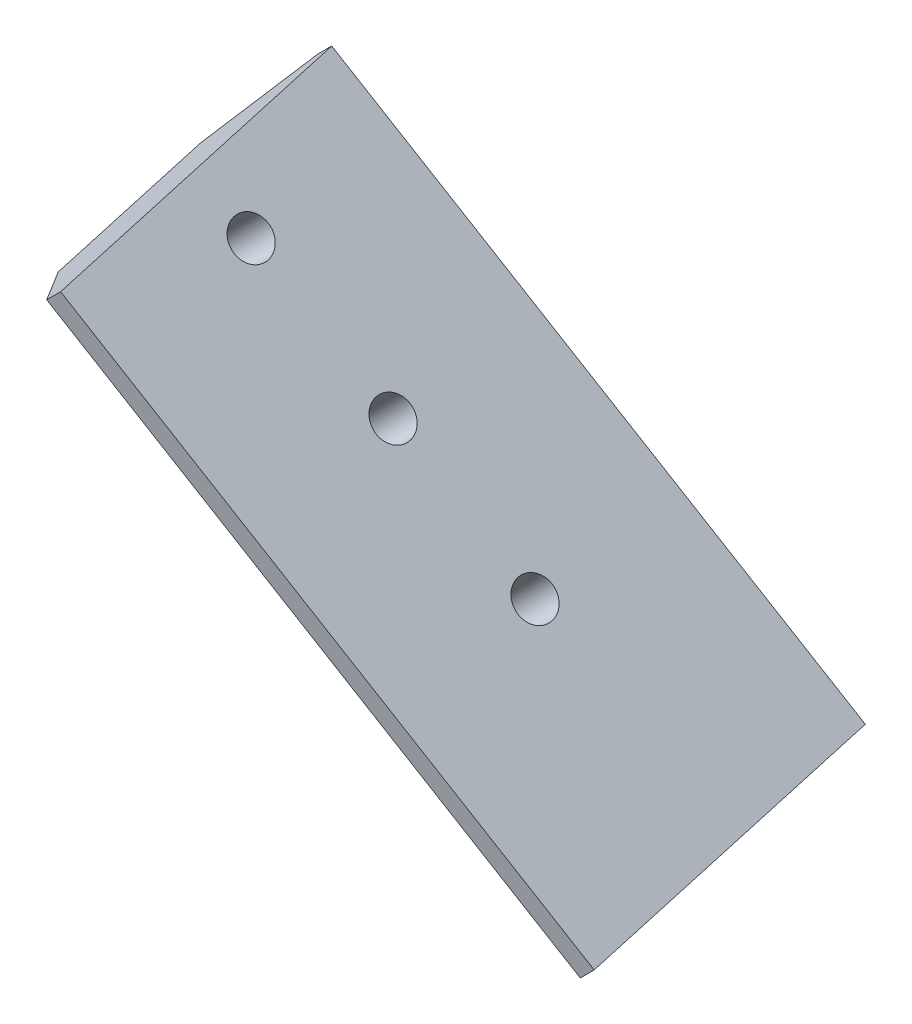
ISO-10303-21;
HEADER;
FILE_DESCRIPTION(('STEP AP214'),'2;1');
FILE_NAME('part.step','',(''),(''),'','','');
FILE_SCHEMA(('AUTOMOTIVE_DESIGN { 1 0 10303 214 1 1 1 1 }'));
ENDSEC;
DATA;
#1=APPLICATION_CONTEXT('core data for automotive mechanical design processes');
#2=APPLICATION_PROTOCOL_DEFINITION('international standard','automotive_design',2000,#1);
#3=PRODUCT_CONTEXT('',#1,'mechanical');
#4=PRODUCT('Part','Part','',(#3));
#5=PRODUCT_RELATED_PRODUCT_CATEGORY('part','',(#4));
#6=PRODUCT_DEFINITION_FORMATION('','',#4);
#7=PRODUCT_DEFINITION_CONTEXT('part definition',#1,'design');
#8=PRODUCT_DEFINITION('design','',#6,#7);
#9=PRODUCT_DEFINITION_SHAPE('','',#8);
#10=(LENGTH_UNIT() NAMED_UNIT(*) SI_UNIT(.MILLI.,.METRE.));
#11=(NAMED_UNIT(*) PLANE_ANGLE_UNIT() SI_UNIT($,.RADIAN.));
#12=(NAMED_UNIT(*) SI_UNIT($,.STERADIAN.) SOLID_ANGLE_UNIT());
#13=UNCERTAINTY_MEASURE_WITH_UNIT(LENGTH_MEASURE(1.E-05),#10,'distance_accuracy_value','');
#14=(GEOMETRIC_REPRESENTATION_CONTEXT(3) GLOBAL_UNCERTAINTY_ASSIGNED_CONTEXT((#13)) GLOBAL_UNIT_ASSIGNED_CONTEXT((#10,
#11,#12)) REPRESENTATION_CONTEXT('',''));
#15=CARTESIAN_POINT('',(0.,0.,0.));
#16=DIRECTION('',(0.,0.,1.));
#17=DIRECTION('',(1.,0.,0.));
#18=AXIS2_PLACEMENT_3D('',#15,#16,#17);
#19=CARTESIAN_POINT('',(2301.17091138971,-454.636764766131,75.5684436134808));
#20=DIRECTION('',(-0.707106781186548,-0.707106781186547,-1.38414541674983E-13));
#21=DIRECTION('',(0.707106781186547,-0.707106781186548,0.));
#22=AXIS2_PLACEMENT_3D('',#19,#20,#21);
#23=CONICAL_SURFACE('',#22,3.45000000012907,0.785398163395434);
#24=CARTESIAN_POINT('',(2301.17091138977,-454.636764766074,75.5684436134808));
#25=DIRECTION('',(-0.707106781186548,-0.707106781186547,-1.38414541674983E-13));
#26=DIRECTION('',(0.707106781186547,-0.707106781186548,0.));
#27=AXIS2_PLACEMENT_3D('',#24,#25,#26);
#28=CIRCLE('',#27,3.45000000004904);
#29=CARTESIAN_POINT('',(2303.6104297849,-457.076283161203,75.5684436134808));
#30=VERTEX_POINT('',#29);
#31=EDGE_CURVE('E122',#30,#30,#28,.F.);
#32=ORIENTED_EDGE('',*,*,#31,.F.);
#33=EDGE_LOOP('',(#32));
#34=FACE_BOUND('',#33,.T.);
#35=CARTESIAN_POINT('',(2301.84266283199,-453.965013323851,75.5684436134809));
#36=DIRECTION('',(-0.707106781186503,-0.707106781186592,0.));
#37=DIRECTION('',(0.707106781186592,-0.707106781186503,0.));
#38=AXIS2_PLACEMENT_3D('',#35,#36,#37);
#39=CIRCLE('',#38,2.5);
#40=CARTESIAN_POINT('',(2303.61042978496,-455.732780276817,75.5684436134809));
#41=VERTEX_POINT('',#40);
#42=EDGE_CURVE('E101',#41,#41,#39,.F.);
#43=ORIENTED_EDGE('',*,*,#42,.T.);
#44=EDGE_LOOP('',(#43));
#45=FACE_BOUND('',#44,.T.);
#46=ADVANCED_FACE('F17',(#34,#45),#23,.F.);
#47=CARTESIAN_POINT('',(2330.07002735808,-483.535880734265,68.36204424156));
#48=DIRECTION('',(-0.707106781186434,-0.707106781186661,0.));
#49=DIRECTION('',(0.707106781186661,-0.707106781186434,0.));
#50=AXIS2_PLACEMENT_3D('',#47,#48,#49);
#51=CONICAL_SURFACE('',#50,3.45000000007031,0.785398163408309);
#52=CARTESIAN_POINT('',(2330.07002735816,-483.535880734184,68.36204424156));
#53=DIRECTION('',(-0.707106781186434,-0.707106781186661,0.));
#54=DIRECTION('',(0.707106781186661,-0.707106781186434,0.));
#55=AXIS2_PLACEMENT_3D('',#52,#53,#54);
#56=CIRCLE('',#55,3.44999999995523);
#57=CARTESIAN_POINT('',(2332.50954575322,-485.975399129245,68.36204424156));
#58=VERTEX_POINT('',#57);
#59=EDGE_CURVE('E20',#58,#58,#56,.F.);
#60=ORIENTED_EDGE('',*,*,#59,.F.);
#61=EDGE_LOOP('',(#60));
#62=FACE_BOUND('',#61,.T.);
#63=CARTESIAN_POINT('',(2330.74177880024,-482.864129292097,68.3620442415602));
#64=DIRECTION('',(-0.707106781186503,-0.707106781186592,0.));
#65=DIRECTION('',(0.707106781186592,-0.707106781186503,0.));
#66=AXIS2_PLACEMENT_3D('',#63,#64,#65);
#67=CIRCLE('',#66,2.5);
#68=CARTESIAN_POINT('',(2332.50954575321,-484.631896245063,68.3620442415602));
#69=VERTEX_POINT('',#68);
#70=EDGE_CURVE('E106',#69,#69,#67,.F.);
#71=ORIENTED_EDGE('',*,*,#70,.T.);
#72=EDGE_LOOP('',(#71));
#73=FACE_BOUND('',#72,.T.);
#74=ADVANCED_FACE('F131',(#62,#73),#51,.F.);
#75=CARTESIAN_POINT('',(2315.62046937664,-469.086322752486,71.965243926872));
#76=DIRECTION('',(-0.707106781186513,-0.707106781186582,0.));
#77=DIRECTION('',(0.707106781186582,-0.707106781186513,0.));
#78=AXIS2_PLACEMENT_3D('',#75,#76,#77);
#79=CONICAL_SURFACE('',#78,3.44999999985659,0.785398163417411);
#80=CARTESIAN_POINT('',(2315.62046937657,-469.086322752556,71.965243926872));
#81=DIRECTION('',(-0.707106781186513,-0.707106781186582,0.));
#82=DIRECTION('',(0.707106781186582,-0.707106781186513,0.));
#83=AXIS2_PLACEMENT_3D('',#80,#81,#82);
#84=CIRCLE('',#83,3.44999999995523);
#85=CARTESIAN_POINT('',(2318.05998777163,-471.525841147618,71.965243926872));
#86=VERTEX_POINT('',#85);
#87=EDGE_CURVE('E103',#86,#86,#84,.F.);
#88=ORIENTED_EDGE('',*,*,#87,.F.);
#89=EDGE_LOOP('',(#88));
#90=FACE_BOUND('',#89,.T.);
#91=CARTESIAN_POINT('',(2316.29222081863,-468.41457131049,71.9652439268721));
#92=DIRECTION('',(-0.707106781186503,-0.707106781186592,0.));
#93=DIRECTION('',(0.707106781186592,-0.707106781186503,0.));
#94=AXIS2_PLACEMENT_3D('',#91,#92,#93);
#95=CIRCLE('',#94,2.5);
#96=CARTESIAN_POINT('',(2318.0599877716,-470.182338263456,71.9652439268721));
#97=VERTEX_POINT('',#96);
#98=EDGE_CURVE('E81',#97,#97,#95,.F.);
#99=ORIENTED_EDGE('',*,*,#98,.T.);
#100=EDGE_LOOP('',(#99));
#101=FACE_BOUND('',#100,.T.);
#102=ADVANCED_FACE('F134',(#90,#101),#79,.F.);
#103=CARTESIAN_POINT('',(2326.32812028619,-466.358944819765,50.6991222747484));
#104=DIRECTION('',(-0.586824088833399,-0.41317591116653,-0.696364240320077));
#105=DIRECTION('',(-0.764688187763723,0.,0.644400477571698));
#106=AXIS2_PLACEMENT_3D('',#103,#104,#105);
#107=PLANE('',#106);
#108=DIRECTION('',(0.696364240320073,-0.696364240319967,-0.173648177666922));
#109=VECTOR('',#108,1.);
#110=CARTESIAN_POINT('',(2294.31524887046,-447.781102246584,66.6534266797069));
#111=LINE('',#110,#109);
#112=CARTESIAN_POINT('',(2294.31524887046,-447.781102246584,66.6534266797069));
#113=VERTEX_POINT('',#112);
#114=CARTESIAN_POINT('',(2348.63165961543,-502.097512991543,53.1088688216854));
#115=VERTEX_POINT('',#114);
#116=EDGE_CURVE('E68',#113,#115,#111,.T.);
#117=ORIENTED_EDGE('',*,*,#116,.F.);
#118=DIRECTION('',(-0.413175911166596,-0.586824088833598,0.69636424031987));
#119=VECTOR('',#118,1.);
#120=CARTESIAN_POINT('',(2299.86627915403,-439.897103687606,57.2977530260918));
#121=LINE('',#120,#119);
#122=CARTESIAN_POINT('',(2299.86627915403,-439.897103687606,57.2977530260917));
#123=VERTEX_POINT('',#122);
#124=EDGE_CURVE('E84',#123,#113,#121,.T.);
#125=ORIENTED_EDGE('',*,*,#124,.F.);
#126=DIRECTION('',(-0.6963642403201,0.696364240319938,0.173648177666931));
#127=VECTOR('',#126,1.);
#128=CARTESIAN_POINT('',(2354.182689899,-494.213514432563,43.7531951680708));
#129=LINE('',#128,#127);
#130=CARTESIAN_POINT('',(2354.182689899,-494.213514432563,43.7531951680701));
#131=VERTEX_POINT('',#130);
#132=EDGE_CURVE('E73',#131,#123,#129,.T.);
#133=ORIENTED_EDGE('',*,*,#132,.F.);
#134=DIRECTION('',(-0.413175911166616,-0.586824088833581,0.696364240319873));
#135=VECTOR('',#134,1.);
#136=CARTESIAN_POINT('',(2354.182689899,-494.213514432563,43.7531951680711));
#137=LINE('',#136,#135);
#138=EDGE_CURVE('E202',#131,#115,#137,.T.);
#139=ORIENTED_EDGE('',*,*,#138,.T.);
#140=EDGE_LOOP('',(#117,#125,#133,#139));
#141=FACE_BOUND('',#140,.T.);
#142=ADVANCED_FACE('F85',(#141),#107,.T.);
#143=CARTESIAN_POINT('',(2323.35563388597,-476.821487262092,80.7357587416199));
#144=DIRECTION('',(-0.707106781186503,-0.707106781186592,0.));
#145=DIRECTION('',(0.707106781186592,-0.707106781186503,0.));
#146=AXIS2_PLACEMENT_3D('',#143,#144,#145);
#147=PLANE('',#146);
#148=ORIENTED_EDGE('',*,*,#116,.T.);
#149=DIRECTION('',(0.122787803968983,-0.122787803968964,0.984807753012208));
#150=VECTOR('',#149,1.);
#151=CARTESIAN_POINT('',(2349.92093155711,-503.386784933217,63.4493502283161));
#152=LINE('',#151,#150);
#153=CARTESIAN_POINT('',(2351.21020349878,-504.676056874893,73.7898316349431));
#154=VERTEX_POINT('',#153);
#155=EDGE_CURVE('E199',#115,#154,#152,.T.);
#156=ORIENTED_EDGE('',*,*,#155,.T.);
#157=DIRECTION('',(0.696364240320092,-0.696364240319951,-0.173648177666907));
#158=VECTOR('',#157,1.);
#159=CARTESIAN_POINT('',(2296.89379275381,-450.359646129935,87.3343894929638));
#160=LINE('',#159,#158);
#161=CARTESIAN_POINT('',(2296.89379275381,-450.359646129935,87.3343894929635));
#162=VERTEX_POINT('',#161);
#163=EDGE_CURVE('E98',#162,#154,#160,.T.);
#164=ORIENTED_EDGE('',*,*,#163,.F.);
#165=DIRECTION('',(0.122787803968983,-0.122787803968964,0.984807753012208));
#166=VECTOR('',#165,1.);
#167=CARTESIAN_POINT('',(2295.60452081214,-449.07037418826,76.9939080863367));
#168=LINE('',#167,#166);
#169=EDGE_CURVE('E88',#113,#162,#168,.T.);
#170=ORIENTED_EDGE('',*,*,#169,.F.);
#171=EDGE_LOOP('',(#148,#156,#164,#170));
#172=FACE_BOUND('',#171,.T.);
#173=ORIENTED_EDGE('',*,*,#87,.T.);
#174=EDGE_LOOP('',(#173));
#175=FACE_BOUND('',#174,.T.);
#176=ORIENTED_EDGE('',*,*,#31,.T.);
#177=EDGE_LOOP('',(#176));
#178=FACE_BOUND('',#177,.T.);
#179=ORIENTED_EDGE('',*,*,#59,.T.);
#180=EDGE_LOOP('',(#179));
#181=FACE_BOUND('',#180,.T.);
#182=ADVANCED_FACE('F129',(#172,#175,#178,#181),#147,.T.);
#183=CARTESIAN_POINT('',(2323.35563388597,-476.821487262092,80.7357587416199));
#184=DIRECTION('',(-0.413175911166535,-0.586824088833529,0.696364240319965));
#185=DIRECTION('',(0.,-0.764688187763602,-0.644400477571842));
#186=AXIS2_PLACEMENT_3D('',#183,#184,#185);
#187=PLANE('',#186);
#188=DIRECTION('',(0.696364240320033,-0.696364240320004,-0.173648177666931));
#189=VECTOR('',#188,1.);
#190=CARTESIAN_POINT('',(2304.77779131279,-444.808615846367,96.6900631465797));
#191=LINE('',#190,#189);
#192=CARTESIAN_POINT('',(2304.77779131279,-444.808615846367,96.6900631465809));
#193=VERTEX_POINT('',#192);
#194=CARTESIAN_POINT('',(2359.09420205775,-499.125026591325,83.1455052885593));
#195=VERTEX_POINT('',#194);
#196=EDGE_CURVE('E211',#193,#195,#191,.T.);
#197=ORIENTED_EDGE('',*,*,#196,.F.);
#198=DIRECTION('',(0.586824088833433,0.413175911166614,0.696364240319999));
#199=VECTOR('',#198,1.);
#200=CARTESIAN_POINT('',(2296.89379275381,-450.359646129934,87.3343894929633));
#201=LINE('',#200,#199);
#202=EDGE_CURVE('E213',#162,#193,#201,.T.);
#203=ORIENTED_EDGE('',*,*,#202,.F.);
#204=ORIENTED_EDGE('',*,*,#163,.T.);
#205=DIRECTION('',(0.586824088833312,0.413175911166412,0.696364240320221));
#206=VECTOR('',#205,1.);
#207=CARTESIAN_POINT('',(2351.21020349878,-504.676056874891,73.7898316349427));
#208=LINE('',#207,#206);
#209=EDGE_CURVE('E198',#154,#195,#208,.T.);
#210=ORIENTED_EDGE('',*,*,#209,.T.);
#211=EDGE_LOOP('',(#197,#203,#204,#210));
#212=FACE_BOUND('',#211,.T.);
#213=ADVANCED_FACE('F154',(#212),#187,.T.);
#214=CARTESIAN_POINT('',(2301.17091138986,-454.636764765981,75.5684436134808));
#215=DIRECTION('',(-0.707106781186503,-0.707106781186592,0.));
#216=DIRECTION('',(0.707106781186592,-0.707106781186503,0.));
#217=AXIS2_PLACEMENT_3D('',#214,#215,#216);
#218=CYLINDRICAL_SURFACE('',#217,2.5);
#219=ORIENTED_EDGE('',*,*,#42,.F.);
#220=EDGE_LOOP('',(#219));
#221=FACE_BOUND('',#220,.T.);
#222=CARTESIAN_POINT('',(2309.6561927641,-446.151483391741,75.5684436134817));
#223=DIRECTION('',(-0.707106781186503,-0.707106781186592,0.));
#224=DIRECTION('',(0.707106781186592,-0.707106781186503,0.));
#225=AXIS2_PLACEMENT_3D('',#222,#223,#224);
#226=CIRCLE('',#225,2.5);
#227=CARTESIAN_POINT('',(2311.42395971707,-447.919250344707,75.5684436134817));
#228=VERTEX_POINT('',#227);
#229=EDGE_CURVE('E118',#228,#228,#226,.T.);
#230=ORIENTED_EDGE('',*,*,#229,.F.);
#231=EDGE_LOOP('',(#230));
#232=FACE_BOUND('',#231,.T.);
#233=ADVANCED_FACE('F141',(#221,#232),#218,.F.);
#234=CARTESIAN_POINT('',(2330.07002735811,-483.535880734226,68.3620442415601));
#235=DIRECTION('',(-0.707106781186503,-0.707106781186592,0.));
#236=DIRECTION('',(0.707106781186592,-0.707106781186503,0.));
#237=AXIS2_PLACEMENT_3D('',#234,#235,#236);
#238=CYLINDRICAL_SURFACE('',#237,2.5);
#239=ORIENTED_EDGE('',*,*,#70,.F.);
#240=EDGE_LOOP('',(#239));
#241=FACE_BOUND('',#240,.T.);
#242=CARTESIAN_POINT('',(2338.55530873235,-475.050599359986,68.362044241561));
#243=DIRECTION('',(-0.707106781186503,-0.707106781186592,0.));
#244=DIRECTION('',(0.707106781186592,-0.707106781186503,0.));
#245=AXIS2_PLACEMENT_3D('',#242,#243,#244);
#246=CIRCLE('',#245,2.5);
#247=CARTESIAN_POINT('',(2340.32307568532,-476.818366312952,68.362044241561));
#248=VERTEX_POINT('',#247);
#249=EDGE_CURVE('E115',#248,#248,#246,.T.);
#250=ORIENTED_EDGE('',*,*,#249,.F.);
#251=EDGE_LOOP('',(#250));
#252=FACE_BOUND('',#251,.T.);
#253=ADVANCED_FACE('F137',(#241,#252),#238,.F.);
#254=CARTESIAN_POINT('',(2315.6204693765,-469.08632275262,71.965243926872));
#255=DIRECTION('',(-0.707106781186503,-0.707106781186592,0.));
#256=DIRECTION('',(0.707106781186592,-0.707106781186503,0.));
#257=AXIS2_PLACEMENT_3D('',#254,#255,#256);
#258=CYLINDRICAL_SURFACE('',#257,2.5);
#259=CARTESIAN_POINT('',(2324.10575075074,-460.60104137838,71.9652439268729));
#260=DIRECTION('',(-0.707106781186503,-0.707106781186592,0.));
#261=DIRECTION('',(0.707106781186592,-0.707106781186503,0.));
#262=AXIS2_PLACEMENT_3D('',#259,#260,#261);
#263=CIRCLE('',#262,2.5);
#264=CARTESIAN_POINT('',(2325.87351770371,-462.368808331346,71.9652439268729));
#265=VERTEX_POINT('',#264);
#266=EDGE_CURVE('E111',#265,#265,#263,.T.);
#267=ORIENTED_EDGE('',*,*,#266,.F.);
#268=EDGE_LOOP('',(#267));
#269=FACE_BOUND('',#268,.T.);
#270=ORIENTED_EDGE('',*,*,#98,.F.);
#271=EDGE_LOOP('',(#270));
#272=FACE_BOUND('',#271,.T.);
#273=ADVANCED_FACE('F140',(#269,#272),#258,.F.);
#274=CARTESIAN_POINT('',(2328.09588723916,-464.591177866798,50.6991222747486));
#275=DIRECTION('',(-0.122787803968928,0.122787803969019,-0.984807753012208));
#276=DIRECTION('',(0.,0.992316665359125,0.12372403020653));
#277=AXIS2_PLACEMENT_3D('',#274,#275,#276);
#278=PLANE('',#277);
#279=ORIENTED_EDGE('',*,*,#132,.T.);
#280=DIRECTION('',(-0.707106781186494,-0.707106781186601,0.));
#281=VECTOR('',#280,1.);
#282=CARTESIAN_POINT('',(2306.5837935753,-433.179589266335,57.2977530260925));
#283=LINE('',#282,#281);
#284=CARTESIAN_POINT('',(2301.634046107,-438.129336734641,57.2977530260919));
#285=VERTEX_POINT('',#284);
#286=EDGE_CURVE('E76',#285,#123,#283,.T.);
#287=ORIENTED_EDGE('',*,*,#286,.F.);
#288=DIRECTION('',(-0.696364240320071,0.696364240319964,0.17364817766694));
#289=VECTOR('',#288,1.);
#290=CARTESIAN_POINT('',(2355.95045685196,-492.445747479596,43.7531951680713));
#291=LINE('',#290,#289);
#292=CARTESIAN_POINT('',(2355.95045685196,-492.445747479598,43.7531951680713));
#293=VERTEX_POINT('',#292);
#294=EDGE_CURVE('E114',#293,#285,#291,.T.);
#295=ORIENTED_EDGE('',*,*,#294,.F.);
#296=DIRECTION('',(-0.707106781186494,-0.707106781186601,0.));
#297=VECTOR('',#296,1.);
#298=CARTESIAN_POINT('',(2360.90020432027,-487.496000011292,43.7531951680707));
#299=LINE('',#298,#297);
#300=EDGE_CURVE('E79',#293,#131,#299,.T.);
#301=ORIENTED_EDGE('',*,*,#300,.T.);
#302=EDGE_LOOP('',(#279,#287,#295,#301));
#303=FACE_BOUND('',#302,.T.);
#304=ADVANCED_FACE('F74',(#303),#278,.T.);
#305=CARTESIAN_POINT('',(2309.03954965468,-435.635345345714,76.9939080863367));
#306=DIRECTION('',(-0.696364240320072,0.696364240319966,0.173648177666931));
#307=DIRECTION('',(-0.707106781186494,-0.707106781186601,0.));
#308=AXIS2_PLACEMENT_3D('',#305,#306,#307);
#309=PLANE('',#308);
#310=ORIENTED_EDGE('',*,*,#202,.T.);
#311=DIRECTION('',(-0.70710678118506,-0.707106781188035,-4.38538094727734E-13));
#312=VECTOR('',#311,1.);
#313=CARTESIAN_POINT('',(2306.54555826575,-443.0408488934,96.6900631465808));
#314=LINE('',#313,#312);
#315=CARTESIAN_POINT('',(2306.54555826575,-443.0408488934,96.6900631465805));
#316=VERTEX_POINT('',#315);
#317=EDGE_CURVE('E208',#316,#193,#314,.T.);
#318=ORIENTED_EDGE('',*,*,#317,.F.);
#319=DIRECTION('',(0.12278780396883,-0.122787803968923,0.984807753012232));
#320=VECTOR('',#319,1.);
#321=CARTESIAN_POINT('',(2301.634046107,-438.129336734641,57.297753026092));
#322=LINE('',#321,#320);
#323=EDGE_CURVE('E93',#285,#316,#322,.T.);
#324=ORIENTED_EDGE('',*,*,#323,.F.);
#325=ORIENTED_EDGE('',*,*,#286,.T.);
#326=ORIENTED_EDGE('',*,*,#124,.T.);
#327=ORIENTED_EDGE('',*,*,#169,.T.);
#328=EDGE_LOOP('',(#310,#318,#324,#325,#326,#327));
#329=FACE_BOUND('',#328,.T.);
#330=ADVANCED_FACE('F91',(#329),#309,.T.);
#331=CARTESIAN_POINT('',(2331.23963244495,-471.270456978526,90.0914323952366));
#332=DIRECTION('',(0.122787803968928,-0.122787803969019,0.984807753012208));
#333=DIRECTION('',(0.,-0.992316665359125,-0.12372403020653));
#334=AXIS2_PLACEMENT_3D('',#331,#332,#333);
#335=PLANE('',#334);
#336=DIRECTION('',(0.696364240320073,-0.696364240319966,-0.173648177666924));
#337=VECTOR('',#336,1.);
#338=CARTESIAN_POINT('',(2306.54555826575,-443.040848893398,96.6900631465802));
#339=LINE('',#338,#337);
#340=CARTESIAN_POINT('',(2360.86196901072,-497.357259638358,83.1455052885592));
#341=VERTEX_POINT('',#340);
#342=EDGE_CURVE('E26',#316,#341,#339,.T.);
#343=ORIENTED_EDGE('',*,*,#342,.F.);
#344=ORIENTED_EDGE('',*,*,#317,.T.);
#345=ORIENTED_EDGE('',*,*,#196,.T.);
#346=DIRECTION('',(-0.707106781186494,-0.707106781186601,0.));
#347=VECTOR('',#346,1.);
#348=CARTESIAN_POINT('',(2365.81171647903,-492.40751217005,83.1455052885585));
#349=LINE('',#348,#347);
#350=EDGE_CURVE('E35',#195,#341,#349,.F.);
#351=ORIENTED_EDGE('',*,*,#350,.T.);
#352=EDGE_LOOP('',(#343,#344,#345,#351));
#353=FACE_BOUND('',#352,.T.);
#354=ADVANCED_FACE('F189',(#353),#335,.T.);
#355=CARTESIAN_POINT('',(2363.35596039965,-489.951756090671,63.4493502283161));
#356=DIRECTION('',(-0.696364240320072,0.696364240319966,0.173648177666931));
#357=DIRECTION('',(-0.707106781186494,-0.707106781186601,0.));
#358=AXIS2_PLACEMENT_3D('',#355,#356,#357);
#359=PLANE('',#358);
#360=ORIENTED_EDGE('',*,*,#209,.F.);
#361=ORIENTED_EDGE('',*,*,#155,.F.);
#362=ORIENTED_EDGE('',*,*,#138,.F.);
#363=ORIENTED_EDGE('',*,*,#300,.F.);
#364=DIRECTION('',(-0.122787803968959,0.122787803969052,-0.9848077530122));
#365=VECTOR('',#364,1.);
#366=CARTESIAN_POINT('',(2360.86196901072,-497.357259638358,83.1455052885595));
#367=LINE('',#366,#365);
#368=EDGE_CURVE('E11',#341,#293,#367,.T.);
#369=ORIENTED_EDGE('',*,*,#368,.F.);
#370=ORIENTED_EDGE('',*,*,#350,.F.);
#371=EDGE_LOOP('',(#360,#361,#362,#363,#369,#370));
#372=FACE_BOUND('',#371,.T.);
#373=ADVANCED_FACE('F148',(#372),#359,.F.);
#374=CARTESIAN_POINT('',(2328.09588723916,-464.591177866798,50.6991222747486));
#375=DIRECTION('',(0.707106781186503,0.707106781186592,0.));
#376=DIRECTION('',(-0.707106781186592,0.707106781186503,0.));
#377=AXIS2_PLACEMENT_3D('',#374,#375,#376);
#378=PLANE('',#377);
#379=ORIENTED_EDGE('',*,*,#342,.T.);
#380=ORIENTED_EDGE('',*,*,#368,.T.);
#381=ORIENTED_EDGE('',*,*,#294,.T.);
#382=ORIENTED_EDGE('',*,*,#323,.T.);
#383=EDGE_LOOP('',(#379,#380,#381,#382));
#384=FACE_BOUND('',#383,.T.);
#385=ORIENTED_EDGE('',*,*,#266,.T.);
#386=EDGE_LOOP('',(#385));
#387=FACE_BOUND('',#386,.T.);
#388=ORIENTED_EDGE('',*,*,#249,.T.);
#389=EDGE_LOOP('',(#388));
#390=FACE_BOUND('',#389,.T.);
#391=ORIENTED_EDGE('',*,*,#229,.T.);
#392=EDGE_LOOP('',(#391));
#393=FACE_BOUND('',#392,.T.);
#394=ADVANCED_FACE('F145',(#384,#387,#390,#393),#378,.T.);
#395=CLOSED_SHELL('',(#46,#74,#102,#142,#182,#213,#233,#253,#273,#304,#330,#354,#373,#394));
#396=MANIFOLD_SOLID_BREP('B1',#395);
#397=ADVANCED_BREP_SHAPE_REPRESENTATION('',(#18,#396),#14);
#398=SHAPE_DEFINITION_REPRESENTATION(#9,#397);
ENDSEC;
END-ISO-10303-21;
